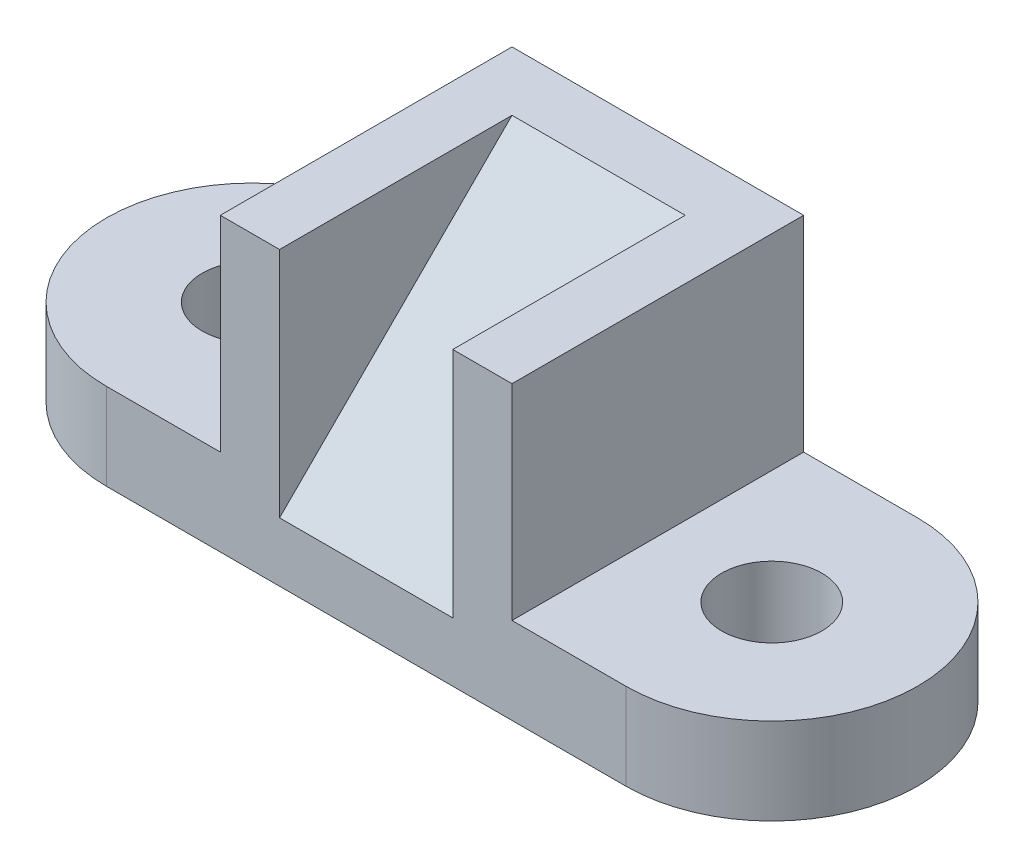
ISO-10303-21;
HEADER;
FILE_DESCRIPTION(('STEP AP214'),'2;1');
FILE_NAME('part.step','',(''),(''),'','','');
FILE_SCHEMA(('AUTOMOTIVE_DESIGN { 1 0 10303 214 1 1 1 1 }'));
ENDSEC;
DATA;
#1=APPLICATION_CONTEXT('core data for automotive mechanical design processes');
#2=APPLICATION_PROTOCOL_DEFINITION('international standard','automotive_design',2000,#1);
#3=PRODUCT_CONTEXT('',#1,'mechanical');
#4=PRODUCT('Part','Part','',(#3));
#5=PRODUCT_RELATED_PRODUCT_CATEGORY('part','',(#4));
#6=PRODUCT_DEFINITION_FORMATION('','',#4);
#7=PRODUCT_DEFINITION_CONTEXT('part definition',#1,'design');
#8=PRODUCT_DEFINITION('design','',#6,#7);
#9=PRODUCT_DEFINITION_SHAPE('','',#8);
#10=(LENGTH_UNIT() NAMED_UNIT(*) SI_UNIT(.MILLI.,.METRE.));
#11=(NAMED_UNIT(*) PLANE_ANGLE_UNIT() SI_UNIT($,.RADIAN.));
#12=(NAMED_UNIT(*) SI_UNIT($,.STERADIAN.) SOLID_ANGLE_UNIT());
#13=UNCERTAINTY_MEASURE_WITH_UNIT(LENGTH_MEASURE(1.E-05),#10,'distance_accuracy_value','');
#14=(GEOMETRIC_REPRESENTATION_CONTEXT(3) GLOBAL_UNCERTAINTY_ASSIGNED_CONTEXT((#13)) GLOBAL_UNIT_ASSIGNED_CONTEXT((#10,
#11,#12)) REPRESENTATION_CONTEXT('',''));
#15=CARTESIAN_POINT('',(0.,0.,0.));
#16=DIRECTION('',(0.,0.,1.));
#17=DIRECTION('',(1.,0.,0.));
#18=AXIS2_PLACEMENT_3D('',#15,#16,#17);
#19=CARTESIAN_POINT('',(76.,64.,0.));
#20=DIRECTION('',(1.,0.,0.));
#21=DIRECTION('',(0.,0.,-1.));
#22=AXIS2_PLACEMENT_3D('',#19,#20,#21);
#23=PLANE('',#22);
#24=DIRECTION('',(0.,-0.707106781186548,0.707106781186548));
#25=VECTOR('',#24,1.);
#26=CARTESIAN_POINT('',(76.,64.,-19.));
#27=LINE('',#26,#25);
#28=CARTESIAN_POINT('',(76.,64.,-19.));
#29=VERTEX_POINT('',#28);
#30=CARTESIAN_POINT('',(76.,13.,32.));
#31=VERTEX_POINT('',#30);
#32=EDGE_CURVE('E131',#29,#31,#27,.T.);
#33=ORIENTED_EDGE('',*,*,#32,.T.);
#34=DIRECTION('',(0.,-1.,0.));
#35=VECTOR('',#34,1.);
#36=CARTESIAN_POINT('',(76.,64.,32.));
#37=LINE('',#36,#35);
#38=CARTESIAN_POINT('',(76.,64.,32.));
#39=VERTEX_POINT('',#38);
#40=EDGE_CURVE('E118',#39,#31,#37,.T.);
#41=ORIENTED_EDGE('',*,*,#40,.F.);
#42=DIRECTION('',(0.,0.,1.));
#43=VECTOR('',#42,1.);
#44=CARTESIAN_POINT('',(76.,64.,0.));
#45=LINE('',#44,#43);
#46=EDGE_CURVE('E132',#29,#39,#45,.T.);
#47=ORIENTED_EDGE('',*,*,#46,.F.);
#48=EDGE_LOOP('',(#33,#41,#47));
#49=FACE_BOUND('',#48,.T.);
#50=ADVANCED_FACE('F35',(#49),#23,.F.);
#51=CARTESIAN_POINT('',(38.,64.,0.));
#52=DIRECTION('',(-1.,0.,0.));
#53=DIRECTION('',(0.,0.,1.));
#54=AXIS2_PLACEMENT_3D('',#51,#52,#53);
#55=PLANE('',#54);
#56=DIRECTION('',(0.,-0.707106781186547,0.707106781186547));
#57=VECTOR('',#56,1.);
#58=CARTESIAN_POINT('',(38.,64.,-19.));
#59=LINE('',#58,#57);
#60=CARTESIAN_POINT('',(38.,64.,-19.));
#61=VERTEX_POINT('',#60);
#62=CARTESIAN_POINT('',(38.,13.,32.));
#63=VERTEX_POINT('',#62);
#64=EDGE_CURVE('E136',#61,#63,#59,.T.);
#65=ORIENTED_EDGE('',*,*,#64,.F.);
#66=DIRECTION('',(0.,0.,-1.));
#67=VECTOR('',#66,1.);
#68=CARTESIAN_POINT('',(38.,64.,0.));
#69=LINE('',#68,#67);
#70=CARTESIAN_POINT('',(38.,64.,32.));
#71=VERTEX_POINT('',#70);
#72=EDGE_CURVE('E179',#71,#61,#69,.T.);
#73=ORIENTED_EDGE('',*,*,#72,.F.);
#74=DIRECTION('',(0.,-1.,0.));
#75=VECTOR('',#74,1.);
#76=CARTESIAN_POINT('',(38.,64.,32.));
#77=LINE('',#76,#75);
#78=EDGE_CURVE('E50',#71,#63,#77,.T.);
#79=ORIENTED_EDGE('',*,*,#78,.T.);
#80=EDGE_LOOP('',(#65,#73,#79));
#81=FACE_BOUND('',#80,.T.);
#82=ADVANCED_FACE('F248',(#81),#55,.F.);
#83=CARTESIAN_POINT('',(0.,19.,-32.));
#84=DIRECTION('',(0.,0.,-1.));
#85=DIRECTION('',(-1.,0.,0.));
#86=AXIS2_PLACEMENT_3D('',#83,#84,#85);
#87=PLANE('',#86);
#88=DIRECTION('',(1.,0.,0.));
#89=VECTOR('',#88,1.);
#90=CARTESIAN_POINT('',(0.,0.,-32.));
#91=LINE('',#90,#89);
#92=CARTESIAN_POINT('',(0.,0.,-32.));
#93=VERTEX_POINT('',#92);
#94=CARTESIAN_POINT('',(114.,0.,-32.));
#95=VERTEX_POINT('',#94);
#96=EDGE_CURVE('E208',#93,#95,#91,.T.);
#97=ORIENTED_EDGE('',*,*,#96,.F.);
#98=DIRECTION('',(0.,-1.,0.));
#99=VECTOR('',#98,1.);
#100=CARTESIAN_POINT('',(0.,19.,-32.));
#101=LINE('',#100,#99);
#102=CARTESIAN_POINT('',(0.,19.,-32.));
#103=VERTEX_POINT('',#102);
#104=EDGE_CURVE('E11',#103,#93,#101,.T.);
#105=ORIENTED_EDGE('',*,*,#104,.F.);
#106=DIRECTION('',(1.,0.,0.));
#107=VECTOR('',#106,1.);
#108=CARTESIAN_POINT('',(0.,19.,-32.));
#109=LINE('',#108,#107);
#110=CARTESIAN_POINT('',(25.,19.,-32.));
#111=VERTEX_POINT('',#110);
#112=EDGE_CURVE('E195',#103,#111,#109,.T.);
#113=ORIENTED_EDGE('',*,*,#112,.T.);
#114=DIRECTION('',(0.,-1.,0.));
#115=VECTOR('',#114,1.);
#116=CARTESIAN_POINT('',(25.,64.,-32.));
#117=LINE('',#116,#115);
#118=CARTESIAN_POINT('',(25.,64.,-32.));
#119=VERTEX_POINT('',#118);
#120=EDGE_CURVE('E186',#119,#111,#117,.T.);
#121=ORIENTED_EDGE('',*,*,#120,.F.);
#122=DIRECTION('',(1.,0.,0.));
#123=VECTOR('',#122,1.);
#124=CARTESIAN_POINT('',(0.,64.,-32.));
#125=LINE('',#124,#123);
#126=CARTESIAN_POINT('',(89.,64.,-32.));
#127=VERTEX_POINT('',#126);
#128=EDGE_CURVE('E174',#119,#127,#125,.T.);
#129=ORIENTED_EDGE('',*,*,#128,.T.);
#130=DIRECTION('',(0.,-1.,0.));
#131=VECTOR('',#130,1.);
#132=CARTESIAN_POINT('',(89.,64.,-32.));
#133=LINE('',#132,#131);
#134=CARTESIAN_POINT('',(89.,19.,-32.));
#135=VERTEX_POINT('',#134);
#136=EDGE_CURVE('E189',#127,#135,#133,.T.);
#137=ORIENTED_EDGE('',*,*,#136,.T.);
#138=DIRECTION('',(1.,0.,0.));
#139=VECTOR('',#138,1.);
#140=CARTESIAN_POINT('',(0.,19.,-32.));
#141=LINE('',#140,#139);
#142=CARTESIAN_POINT('',(114.,19.,-32.));
#143=VERTEX_POINT('',#142);
#144=EDGE_CURVE('E154',#135,#143,#141,.T.);
#145=ORIENTED_EDGE('',*,*,#144,.T.);
#146=DIRECTION('',(0.,-1.,0.));
#147=VECTOR('',#146,1.);
#148=CARTESIAN_POINT('',(114.,19.,-32.));
#149=LINE('',#148,#147);
#150=EDGE_CURVE('E157',#143,#95,#149,.T.);
#151=ORIENTED_EDGE('',*,*,#150,.T.);
#152=EDGE_LOOP('',(#97,#105,#113,#121,#129,#137,#145,#151));
#153=FACE_BOUND('',#152,.T.);
#154=ADVANCED_FACE('F226',(#153),#87,.T.);
#155=CARTESIAN_POINT('',(0.,19.,0.));
#156=DIRECTION('',(0.,-1.,0.));
#157=DIRECTION('',(0.,0.,-1.));
#158=AXIS2_PLACEMENT_3D('',#155,#156,#157);
#159=CYLINDRICAL_SURFACE('',#158,32.);
#160=CARTESIAN_POINT('',(0.,0.,0.));
#161=DIRECTION('',(0.,1.,0.));
#162=DIRECTION('',(0.,0.,1.));
#163=AXIS2_PLACEMENT_3D('',#160,#161,#162);
#164=CIRCLE('',#163,32.);
#165=CARTESIAN_POINT('',(0.,0.,32.));
#166=VERTEX_POINT('',#165);
#167=EDGE_CURVE('E210',#93,#166,#164,.T.);
#168=ORIENTED_EDGE('',*,*,#167,.T.);
#169=DIRECTION('',(0.,-1.,0.));
#170=VECTOR('',#169,1.);
#171=CARTESIAN_POINT('',(0.,19.,32.));
#172=LINE('',#171,#170);
#173=CARTESIAN_POINT('',(0.,19.,32.));
#174=VERTEX_POINT('',#173);
#175=EDGE_CURVE('E43',#174,#166,#172,.T.);
#176=ORIENTED_EDGE('',*,*,#175,.F.);
#177=CARTESIAN_POINT('',(0.,19.,0.));
#178=DIRECTION('',(0.,1.,0.));
#179=DIRECTION('',(0.,0.,1.));
#180=AXIS2_PLACEMENT_3D('',#177,#178,#179);
#181=CIRCLE('',#180,32.);
#182=EDGE_CURVE('E198',#103,#174,#181,.T.);
#183=ORIENTED_EDGE('',*,*,#182,.F.);
#184=ORIENTED_EDGE('',*,*,#104,.T.);
#185=EDGE_LOOP('',(#168,#176,#183,#184));
#186=FACE_BOUND('',#185,.T.);
#187=ADVANCED_FACE('F220',(#186),#159,.T.);
#188=CARTESIAN_POINT('',(0.,19.,32.));
#189=DIRECTION('',(0.,0.,-1.));
#190=DIRECTION('',(-1.,0.,0.));
#191=AXIS2_PLACEMENT_3D('',#188,#189,#190);
#192=PLANE('',#191);
#193=DIRECTION('',(1.,0.,0.));
#194=VECTOR('',#193,1.);
#195=CARTESIAN_POINT('',(0.,0.,32.));
#196=LINE('',#195,#194);
#197=CARTESIAN_POINT('',(114.,0.,32.));
#198=VERTEX_POINT('',#197);
#199=EDGE_CURVE('E196',#166,#198,#196,.T.);
#200=ORIENTED_EDGE('',*,*,#199,.T.);
#201=DIRECTION('',(0.,-1.,0.));
#202=VECTOR('',#201,1.);
#203=CARTESIAN_POINT('',(114.,19.,32.));
#204=LINE('',#203,#202);
#205=CARTESIAN_POINT('',(114.,19.,32.));
#206=VERTEX_POINT('',#205);
#207=EDGE_CURVE('E163',#206,#198,#204,.T.);
#208=ORIENTED_EDGE('',*,*,#207,.F.);
#209=DIRECTION('',(1.,0.,0.));
#210=VECTOR('',#209,1.);
#211=CARTESIAN_POINT('',(0.,19.,32.));
#212=LINE('',#211,#210);
#213=CARTESIAN_POINT('',(89.,19.,32.));
#214=VERTEX_POINT('',#213);
#215=EDGE_CURVE('E149',#214,#206,#212,.T.);
#216=ORIENTED_EDGE('',*,*,#215,.F.);
#217=DIRECTION('',(0.,-1.,0.));
#218=VECTOR('',#217,1.);
#219=CARTESIAN_POINT('',(89.,64.,32.));
#220=LINE('',#219,#218);
#221=CARTESIAN_POINT('',(89.,64.,32.));
#222=VERTEX_POINT('',#221);
#223=EDGE_CURVE('E128',#222,#214,#220,.T.);
#224=ORIENTED_EDGE('',*,*,#223,.F.);
#225=DIRECTION('',(1.,0.,0.));
#226=VECTOR('',#225,1.);
#227=CARTESIAN_POINT('',(0.,64.,32.));
#228=LINE('',#227,#226);
#229=EDGE_CURVE('E125',#39,#222,#228,.T.);
#230=ORIENTED_EDGE('',*,*,#229,.F.);
#231=ORIENTED_EDGE('',*,*,#40,.T.);
#232=DIRECTION('',(1.,0.,0.));
#233=VECTOR('',#232,1.);
#234=CARTESIAN_POINT('',(0.,13.,32.));
#235=LINE('',#234,#233);
#236=EDGE_CURVE('E122',#63,#31,#235,.T.);
#237=ORIENTED_EDGE('',*,*,#236,.F.);
#238=ORIENTED_EDGE('',*,*,#78,.F.);
#239=CARTESIAN_POINT('',(25.,64.,32.));
#240=VERTEX_POINT('',#239);
#241=EDGE_CURVE('E171',#240,#71,#228,.T.);
#242=ORIENTED_EDGE('',*,*,#241,.F.);
#243=DIRECTION('',(0.,-1.,0.));
#244=VECTOR('',#243,1.);
#245=CARTESIAN_POINT('',(25.,64.,32.));
#246=LINE('',#245,#244);
#247=CARTESIAN_POINT('',(25.,19.,32.));
#248=VERTEX_POINT('',#247);
#249=EDGE_CURVE('E183',#240,#248,#246,.T.);
#250=ORIENTED_EDGE('',*,*,#249,.T.);
#251=DIRECTION('',(1.,0.,0.));
#252=VECTOR('',#251,1.);
#253=CARTESIAN_POINT('',(0.,19.,32.));
#254=LINE('',#253,#252);
#255=EDGE_CURVE('E201',#174,#248,#254,.T.);
#256=ORIENTED_EDGE('',*,*,#255,.F.);
#257=ORIENTED_EDGE('',*,*,#175,.T.);
#258=EDGE_LOOP('',(#200,#208,#216,#224,#230,#231,#237,#238,#242,#250,#256,#257));
#259=FACE_BOUND('',#258,.T.);
#260=ADVANCED_FACE('F120',(#259),#192,.F.);
#261=CARTESIAN_POINT('',(0.,19.,0.));
#262=DIRECTION('',(0.,-1.,0.));
#263=DIRECTION('',(0.,0.,-1.));
#264=AXIS2_PLACEMENT_3D('',#261,#262,#263);
#265=CYLINDRICAL_SURFACE('',#264,11.);
#266=CARTESIAN_POINT('',(0.,19.,0.));
#267=DIRECTION('',(0.,1.,0.));
#268=DIRECTION('',(0.,0.,1.));
#269=AXIS2_PLACEMENT_3D('',#266,#267,#268);
#270=CIRCLE('',#269,11.);
#271=CARTESIAN_POINT('',(0.,19.,11.));
#272=VERTEX_POINT('',#271);
#273=EDGE_CURVE('E192',#272,#272,#270,.T.);
#274=ORIENTED_EDGE('',*,*,#273,.T.);
#275=EDGE_LOOP('',(#274));
#276=FACE_BOUND('',#275,.T.);
#277=CARTESIAN_POINT('',(0.,0.,0.));
#278=DIRECTION('',(0.,1.,0.));
#279=DIRECTION('',(0.,0.,1.));
#280=AXIS2_PLACEMENT_3D('',#277,#278,#279);
#281=CIRCLE('',#280,11.);
#282=CARTESIAN_POINT('',(0.,0.,11.));
#283=VERTEX_POINT('',#282);
#284=EDGE_CURVE('E127',#283,#283,#281,.T.);
#285=ORIENTED_EDGE('',*,*,#284,.F.);
#286=EDGE_LOOP('',(#285));
#287=FACE_BOUND('',#286,.T.);
#288=ADVANCED_FACE('F37',(#276,#287),#265,.F.);
#289=CARTESIAN_POINT('',(0.,19.,0.));
#290=DIRECTION('',(0.,1.,0.));
#291=DIRECTION('',(0.,0.,1.));
#292=AXIS2_PLACEMENT_3D('',#289,#290,#291);
#293=PLANE('',#292);
#294=ORIENTED_EDGE('',*,*,#273,.F.);
#295=EDGE_LOOP('',(#294));
#296=FACE_BOUND('',#295,.T.);
#297=ORIENTED_EDGE('',*,*,#112,.F.);
#298=ORIENTED_EDGE('',*,*,#182,.T.);
#299=ORIENTED_EDGE('',*,*,#255,.T.);
#300=DIRECTION('',(0.,0.,1.));
#301=VECTOR('',#300,1.);
#302=CARTESIAN_POINT('',(25.,19.,0.));
#303=LINE('',#302,#301);
#304=EDGE_CURVE('E203',#111,#248,#303,.T.);
#305=ORIENTED_EDGE('',*,*,#304,.F.);
#306=EDGE_LOOP('',(#297,#298,#299,#305));
#307=FACE_BOUND('',#306,.T.);
#308=ADVANCED_FACE('F258',(#296,#307),#293,.T.);
#309=CARTESIAN_POINT('',(0.,0.,0.));
#310=DIRECTION('',(0.,1.,0.));
#311=DIRECTION('',(0.,0.,1.));
#312=AXIS2_PLACEMENT_3D('',#309,#310,#311);
#313=PLANE('',#312);
#314=CARTESIAN_POINT('',(114.,0.,0.));
#315=DIRECTION('',(0.,1.,0.));
#316=DIRECTION('',(0.,0.,1.));
#317=AXIS2_PLACEMENT_3D('',#314,#315,#316);
#318=CIRCLE('',#317,32.);
#319=EDGE_CURVE('E142',#198,#95,#318,.T.);
#320=ORIENTED_EDGE('',*,*,#319,.F.);
#321=ORIENTED_EDGE('',*,*,#199,.F.);
#322=ORIENTED_EDGE('',*,*,#167,.F.);
#323=ORIENTED_EDGE('',*,*,#96,.T.);
#324=EDGE_LOOP('',(#320,#321,#322,#323));
#325=FACE_BOUND('',#324,.T.);
#326=ORIENTED_EDGE('',*,*,#284,.T.);
#327=EDGE_LOOP('',(#326));
#328=FACE_BOUND('',#327,.T.);
#329=CARTESIAN_POINT('',(114.,0.,0.));
#330=DIRECTION('',(0.,1.,0.));
#331=DIRECTION('',(0.,0.,1.));
#332=AXIS2_PLACEMENT_3D('',#329,#330,#331);
#333=CIRCLE('',#332,11.);
#334=CARTESIAN_POINT('',(114.,0.,11.));
#335=VERTEX_POINT('',#334);
#336=EDGE_CURVE('E139',#335,#335,#333,.T.);
#337=ORIENTED_EDGE('',*,*,#336,.T.);
#338=EDGE_LOOP('',(#337));
#339=FACE_BOUND('',#338,.T.);
#340=ADVANCED_FACE('F223',(#325,#328,#339),#313,.F.);
#341=CARTESIAN_POINT('',(25.,64.,0.));
#342=DIRECTION('',(1.,0.,0.));
#343=DIRECTION('',(0.,0.,-1.));
#344=AXIS2_PLACEMENT_3D('',#341,#342,#343);
#345=PLANE('',#344);
#346=ORIENTED_EDGE('',*,*,#120,.T.);
#347=ORIENTED_EDGE('',*,*,#304,.T.);
#348=ORIENTED_EDGE('',*,*,#249,.F.);
#349=DIRECTION('',(0.,0.,1.));
#350=VECTOR('',#349,1.);
#351=CARTESIAN_POINT('',(25.,64.,0.));
#352=LINE('',#351,#350);
#353=EDGE_CURVE('E177',#119,#240,#352,.T.);
#354=ORIENTED_EDGE('',*,*,#353,.F.);
#355=EDGE_LOOP('',(#346,#347,#348,#354));
#356=FACE_BOUND('',#355,.T.);
#357=ADVANCED_FACE('F264',(#356),#345,.F.);
#358=CARTESIAN_POINT('',(89.,64.,0.));
#359=DIRECTION('',(1.,0.,0.));
#360=DIRECTION('',(0.,0.,-1.));
#361=AXIS2_PLACEMENT_3D('',#358,#359,#360);
#362=PLANE('',#361);
#363=DIRECTION('',(0.,0.,1.));
#364=VECTOR('',#363,1.);
#365=CARTESIAN_POINT('',(89.,19.,0.));
#366=LINE('',#365,#364);
#367=EDGE_CURVE('E58',#135,#214,#366,.T.);
#368=ORIENTED_EDGE('',*,*,#367,.F.);
#369=ORIENTED_EDGE('',*,*,#136,.F.);
#370=DIRECTION('',(0.,0.,1.));
#371=VECTOR('',#370,1.);
#372=CARTESIAN_POINT('',(89.,64.,0.));
#373=LINE('',#372,#371);
#374=EDGE_CURVE('E170',#127,#222,#373,.T.);
#375=ORIENTED_EDGE('',*,*,#374,.T.);
#376=ORIENTED_EDGE('',*,*,#223,.T.);
#377=EDGE_LOOP('',(#368,#369,#375,#376));
#378=FACE_BOUND('',#377,.T.);
#379=ADVANCED_FACE('F256',(#378),#362,.T.);
#380=CARTESIAN_POINT('',(0.,64.,0.));
#381=DIRECTION('',(0.,1.,0.));
#382=DIRECTION('',(0.,0.,1.));
#383=AXIS2_PLACEMENT_3D('',#380,#381,#382);
#384=PLANE('',#383);
#385=DIRECTION('',(1.,0.,0.));
#386=VECTOR('',#385,1.);
#387=CARTESIAN_POINT('',(0.,64.,-19.));
#388=LINE('',#387,#386);
#389=EDGE_CURVE('E166',#61,#29,#388,.T.);
#390=ORIENTED_EDGE('',*,*,#389,.T.);
#391=ORIENTED_EDGE('',*,*,#46,.T.);
#392=ORIENTED_EDGE('',*,*,#229,.T.);
#393=ORIENTED_EDGE('',*,*,#374,.F.);
#394=ORIENTED_EDGE('',*,*,#128,.F.);
#395=ORIENTED_EDGE('',*,*,#353,.T.);
#396=ORIENTED_EDGE('',*,*,#241,.T.);
#397=ORIENTED_EDGE('',*,*,#72,.T.);
#398=EDGE_LOOP('',(#390,#391,#392,#393,#394,#395,#396,#397));
#399=FACE_BOUND('',#398,.T.);
#400=ADVANCED_FACE('F308',(#399),#384,.T.);
#401=CARTESIAN_POINT('',(114.,19.,0.));
#402=DIRECTION('',(0.,-1.,0.));
#403=DIRECTION('',(0.,0.,-1.));
#404=AXIS2_PLACEMENT_3D('',#401,#402,#403);
#405=CYLINDRICAL_SURFACE('',#404,32.);
#406=ORIENTED_EDGE('',*,*,#319,.T.);
#407=ORIENTED_EDGE('',*,*,#150,.F.);
#408=CARTESIAN_POINT('',(114.,19.,0.));
#409=DIRECTION('',(0.,1.,0.));
#410=DIRECTION('',(0.,0.,1.));
#411=AXIS2_PLACEMENT_3D('',#408,#409,#410);
#412=CIRCLE('',#411,32.);
#413=EDGE_CURVE('E152',#206,#143,#412,.T.);
#414=ORIENTED_EDGE('',*,*,#413,.F.);
#415=ORIENTED_EDGE('',*,*,#207,.T.);
#416=EDGE_LOOP('',(#406,#407,#414,#415));
#417=FACE_BOUND('',#416,.T.);
#418=ADVANCED_FACE('F230',(#417),#405,.T.);
#419=CARTESIAN_POINT('',(114.,19.,0.));
#420=DIRECTION('',(0.,-1.,0.));
#421=DIRECTION('',(0.,0.,-1.));
#422=AXIS2_PLACEMENT_3D('',#419,#420,#421);
#423=CYLINDRICAL_SURFACE('',#422,11.);
#424=CARTESIAN_POINT('',(114.,19.,0.));
#425=DIRECTION('',(0.,1.,0.));
#426=DIRECTION('',(0.,0.,1.));
#427=AXIS2_PLACEMENT_3D('',#424,#425,#426);
#428=CIRCLE('',#427,11.);
#429=CARTESIAN_POINT('',(114.,19.,11.));
#430=VERTEX_POINT('',#429);
#431=EDGE_CURVE('E146',#430,#430,#428,.T.);
#432=ORIENTED_EDGE('',*,*,#431,.T.);
#433=EDGE_LOOP('',(#432));
#434=FACE_BOUND('',#433,.T.);
#435=ORIENTED_EDGE('',*,*,#336,.F.);
#436=EDGE_LOOP('',(#435));
#437=FACE_BOUND('',#436,.T.);
#438=ADVANCED_FACE('F235',(#434,#437),#423,.F.);
#439=CARTESIAN_POINT('',(0.,19.,0.));
#440=DIRECTION('',(0.,1.,0.));
#441=DIRECTION('',(0.,0.,1.));
#442=AXIS2_PLACEMENT_3D('',#439,#440,#441);
#443=PLANE('',#442);
#444=ORIENTED_EDGE('',*,*,#431,.F.);
#445=EDGE_LOOP('',(#444));
#446=FACE_BOUND('',#445,.T.);
#447=ORIENTED_EDGE('',*,*,#215,.T.);
#448=ORIENTED_EDGE('',*,*,#413,.T.);
#449=ORIENTED_EDGE('',*,*,#144,.F.);
#450=ORIENTED_EDGE('',*,*,#367,.T.);
#451=EDGE_LOOP('',(#447,#448,#449,#450));
#452=FACE_BOUND('',#451,.T.);
#453=ADVANCED_FACE('F233',(#446,#452),#443,.T.);
#454=CARTESIAN_POINT('',(146.002,64.,-19.));
#455=DIRECTION('',(0.,-0.707106781186548,-0.707106781186548));
#456=DIRECTION('',(0.,0.707106781186548,-0.707106781186548));
#457=AXIS2_PLACEMENT_3D('',#454,#455,#456);
#458=PLANE('',#457);
#459=ORIENTED_EDGE('',*,*,#32,.F.);
#460=ORIENTED_EDGE('',*,*,#389,.F.);
#461=ORIENTED_EDGE('',*,*,#64,.T.);
#462=ORIENTED_EDGE('',*,*,#236,.T.);
#463=EDGE_LOOP('',(#459,#460,#461,#462));
#464=FACE_BOUND('',#463,.T.);
#465=ADVANCED_FACE('F138',(#464),#458,.F.);
#466=CLOSED_SHELL('',(#50,#82,#154,#187,#260,#288,#308,#340,#357,#379,#400,#418,#438,#453,#465));
#467=MANIFOLD_SOLID_BREP('B2',#466);
#468=ADVANCED_BREP_SHAPE_REPRESENTATION('',(#18,#467),#14);
#469=SHAPE_DEFINITION_REPRESENTATION(#9,#468);
ENDSEC;
END-ISO-10303-21;
